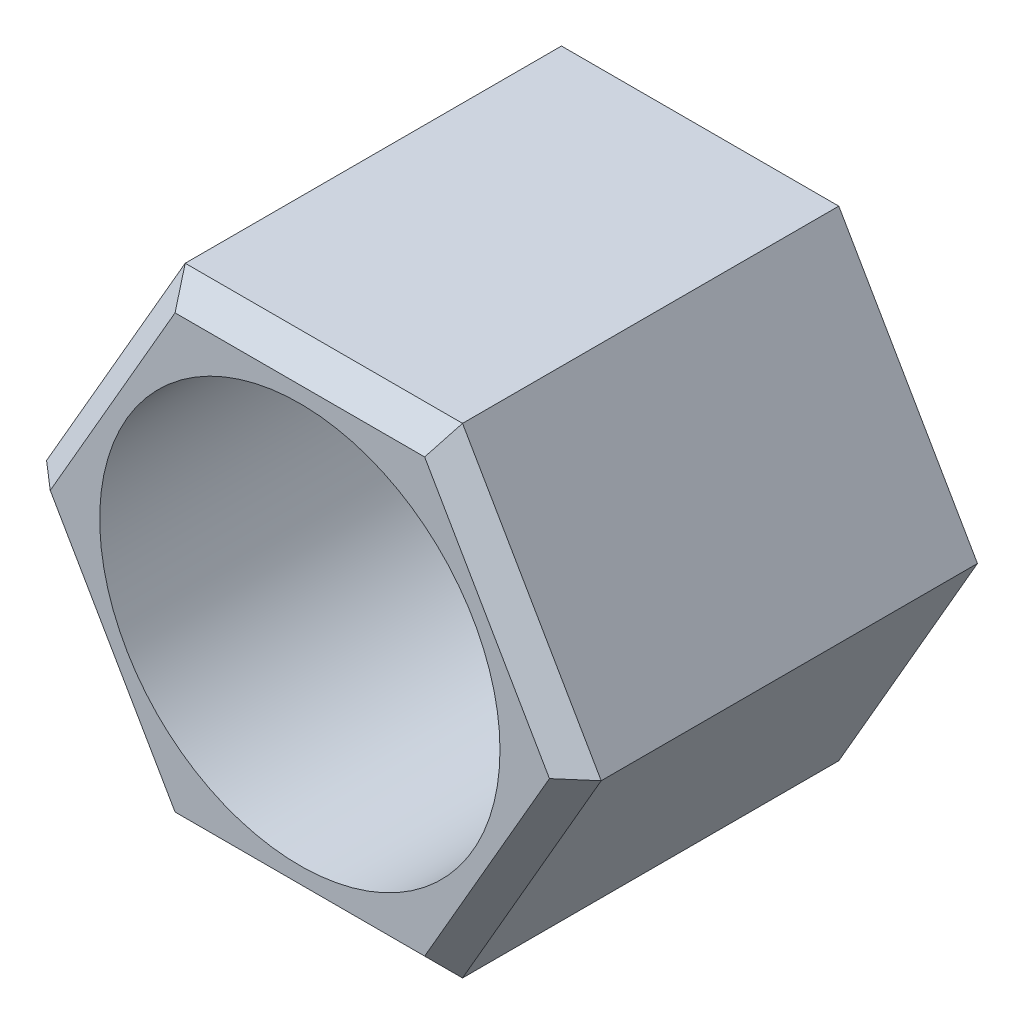
ISO-10303-21;
HEADER;
FILE_DESCRIPTION(('STEP AP214'),'2;1');
FILE_NAME('part.step','',(''),(''),'','','');
FILE_SCHEMA(('AUTOMOTIVE_DESIGN { 1 0 10303 214 1 1 1 1 }'));
ENDSEC;
DATA;
#1=APPLICATION_CONTEXT('core data for automotive mechanical design processes');
#2=APPLICATION_PROTOCOL_DEFINITION('international standard','automotive_design',2000,#1);
#3=PRODUCT_CONTEXT('',#1,'mechanical');
#4=PRODUCT('Part','Part','',(#3));
#5=PRODUCT_RELATED_PRODUCT_CATEGORY('part','',(#4));
#6=PRODUCT_DEFINITION_FORMATION('','',#4);
#7=PRODUCT_DEFINITION_CONTEXT('part definition',#1,'design');
#8=PRODUCT_DEFINITION('design','',#6,#7);
#9=PRODUCT_DEFINITION_SHAPE('','',#8);
#10=(LENGTH_UNIT() NAMED_UNIT(*) SI_UNIT(.MILLI.,.METRE.));
#11=(NAMED_UNIT(*) PLANE_ANGLE_UNIT() SI_UNIT($,.RADIAN.));
#12=(NAMED_UNIT(*) SI_UNIT($,.STERADIAN.) SOLID_ANGLE_UNIT());
#13=UNCERTAINTY_MEASURE_WITH_UNIT(LENGTH_MEASURE(1.E-05),#10,'distance_accuracy_value','');
#14=(GEOMETRIC_REPRESENTATION_CONTEXT(3) GLOBAL_UNCERTAINTY_ASSIGNED_CONTEXT((#13)) GLOBAL_UNIT_ASSIGNED_CONTEXT((#10,
#11,#12)) REPRESENTATION_CONTEXT('',''));
#15=CARTESIAN_POINT('',(0.,0.,0.));
#16=DIRECTION('',(0.,0.,1.));
#17=DIRECTION('',(1.,0.,0.));
#18=AXIS2_PLACEMENT_3D('',#15,#16,#17);
#19=CARTESIAN_POINT('',(4.39940905122495,-7.62,12.7));
#20=DIRECTION('',(-0.866025403784439,0.5,0.));
#21=DIRECTION('',(-0.5,-0.866025403784439,0.));
#22=AXIS2_PLACEMENT_3D('',#19,#20,#21);
#23=PLANE('',#22);
#24=DIRECTION('',(0.,0.,-1.));
#25=VECTOR('',#24,1.);
#26=CARTESIAN_POINT('',(8.7988181024499,0.,12.7));
#27=LINE('',#26,#25);
#28=CARTESIAN_POINT('',(8.7988181024499,0.,11.938));
#29=VERTEX_POINT('',#28);
#30=CARTESIAN_POINT('',(8.7988181024499,0.,0.));
#31=VERTEX_POINT('',#30);
#32=EDGE_CURVE('E93',#29,#31,#27,.T.);
#33=ORIENTED_EDGE('',*,*,#32,.F.);
#34=DIRECTION('',(-0.5,-0.866025403784439,0.));
#35=VECTOR('',#34,1.);
#36=CARTESIAN_POINT('',(4.39940905122495,-7.62,11.938));
#37=LINE('',#36,#35);
#38=CARTESIAN_POINT('',(4.39940905122495,-7.62,11.938));
#39=VERTEX_POINT('',#38);
#40=EDGE_CURVE('E11',#29,#39,#37,.T.);
#41=ORIENTED_EDGE('',*,*,#40,.T.);
#42=DIRECTION('',(0.,0.,-1.));
#43=VECTOR('',#42,1.);
#44=CARTESIAN_POINT('',(4.39940905122495,-7.62,12.7));
#45=LINE('',#44,#43);
#46=CARTESIAN_POINT('',(4.39940905122495,-7.62,0.));
#47=VERTEX_POINT('',#46);
#48=EDGE_CURVE('E114',#39,#47,#45,.T.);
#49=ORIENTED_EDGE('',*,*,#48,.T.);
#50=DIRECTION('',(0.5,0.866025403784439,0.));
#51=VECTOR('',#50,1.);
#52=CARTESIAN_POINT('',(4.39940905122495,-7.62,0.));
#53=LINE('',#52,#51);
#54=EDGE_CURVE('E108',#47,#31,#53,.T.);
#55=ORIENTED_EDGE('',*,*,#54,.T.);
#56=EDGE_LOOP('',(#33,#41,#49,#55));
#57=FACE_BOUND('',#56,.T.);
#58=ADVANCED_FACE('F26',(#57),#23,.F.);
#59=CARTESIAN_POINT('',(8.7988181024499,0.,12.7));
#60=DIRECTION('',(-0.866025403784439,-0.5,0.));
#61=DIRECTION('',(0.5,-0.866025403784439,0.));
#62=AXIS2_PLACEMENT_3D('',#59,#60,#61);
#63=PLANE('',#62);
#64=DIRECTION('',(0.,0.,-1.));
#65=VECTOR('',#64,1.);
#66=CARTESIAN_POINT('',(4.39940905122494,7.62000000000001,12.7));
#67=LINE('',#66,#65);
#68=CARTESIAN_POINT('',(4.39940905122494,7.62000000000001,11.938));
#69=VERTEX_POINT('',#68);
#70=CARTESIAN_POINT('',(4.39940905122494,7.62000000000001,0.));
#71=VERTEX_POINT('',#70);
#72=EDGE_CURVE('E102',#69,#71,#67,.T.);
#73=ORIENTED_EDGE('',*,*,#72,.F.);
#74=DIRECTION('',(0.5,-0.866025403784439,0.));
#75=VECTOR('',#74,1.);
#76=CARTESIAN_POINT('',(8.7988181024499,0.,11.938));
#77=LINE('',#76,#75);
#78=EDGE_CURVE('E33',#69,#29,#77,.T.);
#79=ORIENTED_EDGE('',*,*,#78,.T.);
#80=ORIENTED_EDGE('',*,*,#32,.T.);
#81=DIRECTION('',(-0.5,0.866025403784439,0.));
#82=VECTOR('',#81,1.);
#83=CARTESIAN_POINT('',(8.7988181024499,0.,0.));
#84=LINE('',#83,#82);
#85=EDGE_CURVE('E96',#31,#71,#84,.T.);
#86=ORIENTED_EDGE('',*,*,#85,.T.);
#87=EDGE_LOOP('',(#73,#79,#80,#86));
#88=FACE_BOUND('',#87,.T.);
#89=ADVANCED_FACE('F95',(#88),#63,.F.);
#90=CARTESIAN_POINT('',(4.39940905122494,7.62000000000001,12.7));
#91=DIRECTION('',(0.,-1.,0.));
#92=DIRECTION('',(0.,0.,-1.));
#93=AXIS2_PLACEMENT_3D('',#90,#91,#92);
#94=PLANE('',#93);
#95=DIRECTION('',(0.,0.,-1.));
#96=VECTOR('',#95,1.);
#97=CARTESIAN_POINT('',(-4.39940905122495,7.62000000000001,12.7));
#98=LINE('',#97,#96);
#99=CARTESIAN_POINT('',(-4.39940905122495,7.62000000000001,11.938));
#100=VERTEX_POINT('',#99);
#101=CARTESIAN_POINT('',(-4.39940905122495,7.62000000000001,0.));
#102=VERTEX_POINT('',#101);
#103=EDGE_CURVE('E137',#100,#102,#98,.T.);
#104=ORIENTED_EDGE('',*,*,#103,.F.);
#105=DIRECTION('',(1.,0.,0.));
#106=VECTOR('',#105,1.);
#107=CARTESIAN_POINT('',(4.39940905122494,7.62000000000001,11.938));
#108=LINE('',#107,#106);
#109=EDGE_CURVE('E47',#100,#69,#108,.T.);
#110=ORIENTED_EDGE('',*,*,#109,.T.);
#111=ORIENTED_EDGE('',*,*,#72,.T.);
#112=DIRECTION('',(-1.,0.,0.));
#113=VECTOR('',#112,1.);
#114=CARTESIAN_POINT('',(4.39940905122494,7.62000000000001,0.));
#115=LINE('',#114,#113);
#116=EDGE_CURVE('E111',#71,#102,#115,.T.);
#117=ORIENTED_EDGE('',*,*,#116,.T.);
#118=EDGE_LOOP('',(#104,#110,#111,#117));
#119=FACE_BOUND('',#118,.T.);
#120=ADVANCED_FACE('F167',(#119),#94,.F.);
#121=CARTESIAN_POINT('',(-4.39940905122495,7.62000000000001,12.7));
#122=DIRECTION('',(0.866025403784439,-0.5,0.));
#123=DIRECTION('',(0.5,0.866025403784439,0.));
#124=AXIS2_PLACEMENT_3D('',#121,#122,#123);
#125=PLANE('',#124);
#126=DIRECTION('',(0.,0.,-1.));
#127=VECTOR('',#126,1.);
#128=CARTESIAN_POINT('',(-8.7988181024499,0.,12.7));
#129=LINE('',#128,#127);
#130=CARTESIAN_POINT('',(-8.7988181024499,0.,11.938));
#131=VERTEX_POINT('',#130);
#132=CARTESIAN_POINT('',(-8.7988181024499,0.,0.));
#133=VERTEX_POINT('',#132);
#134=EDGE_CURVE('E135',#131,#133,#129,.T.);
#135=ORIENTED_EDGE('',*,*,#134,.F.);
#136=DIRECTION('',(0.5,0.866025403784439,0.));
#137=VECTOR('',#136,1.);
#138=CARTESIAN_POINT('',(-4.39940905122495,7.62000000000001,11.938));
#139=LINE('',#138,#137);
#140=EDGE_CURVE('E157',#131,#100,#139,.T.);
#141=ORIENTED_EDGE('',*,*,#140,.T.);
#142=ORIENTED_EDGE('',*,*,#103,.T.);
#143=DIRECTION('',(-0.5,-0.866025403784439,0.));
#144=VECTOR('',#143,1.);
#145=CARTESIAN_POINT('',(-4.39940905122495,7.62000000000001,0.));
#146=LINE('',#145,#144);
#147=EDGE_CURVE('E124',#102,#133,#146,.T.);
#148=ORIENTED_EDGE('',*,*,#147,.T.);
#149=EDGE_LOOP('',(#135,#141,#142,#148));
#150=FACE_BOUND('',#149,.T.);
#151=ADVANCED_FACE('F162',(#150),#125,.F.);
#152=CARTESIAN_POINT('',(-8.7988181024499,0.,12.7));
#153=DIRECTION('',(0.866025403784439,0.5,0.));
#154=DIRECTION('',(-0.5,0.866025403784439,0.));
#155=AXIS2_PLACEMENT_3D('',#152,#153,#154);
#156=PLANE('',#155);
#157=DIRECTION('',(0.,0.,-1.));
#158=VECTOR('',#157,1.);
#159=CARTESIAN_POINT('',(-4.39940905122495,-7.62,12.7));
#160=LINE('',#159,#158);
#161=CARTESIAN_POINT('',(-4.39940905122495,-7.62,11.938));
#162=VERTEX_POINT('',#161);
#163=CARTESIAN_POINT('',(-4.39940905122495,-7.62,0.));
#164=VERTEX_POINT('',#163);
#165=EDGE_CURVE('E133',#162,#164,#160,.T.);
#166=ORIENTED_EDGE('',*,*,#165,.F.);
#167=DIRECTION('',(-0.5,0.866025403784439,0.));
#168=VECTOR('',#167,1.);
#169=CARTESIAN_POINT('',(-8.7988181024499,0.,11.938));
#170=LINE('',#169,#168);
#171=EDGE_CURVE('E155',#162,#131,#170,.T.);
#172=ORIENTED_EDGE('',*,*,#171,.T.);
#173=ORIENTED_EDGE('',*,*,#134,.T.);
#174=DIRECTION('',(0.5,-0.866025403784439,0.));
#175=VECTOR('',#174,1.);
#176=CARTESIAN_POINT('',(-8.7988181024499,0.,0.));
#177=LINE('',#176,#175);
#178=EDGE_CURVE('E127',#133,#164,#177,.T.);
#179=ORIENTED_EDGE('',*,*,#178,.T.);
#180=EDGE_LOOP('',(#166,#172,#173,#179));
#181=FACE_BOUND('',#180,.T.);
#182=ADVANCED_FACE('F212',(#181),#156,.F.);
#183=CARTESIAN_POINT('',(-4.39940905122495,-7.62,12.7));
#184=DIRECTION('',(0.,1.,0.));
#185=DIRECTION('',(-1.,0.,0.));
#186=AXIS2_PLACEMENT_3D('',#183,#184,#185);
#187=PLANE('',#186);
#188=ORIENTED_EDGE('',*,*,#48,.F.);
#189=DIRECTION('',(-1.,0.,0.));
#190=VECTOR('',#189,1.);
#191=CARTESIAN_POINT('',(-4.39940905122495,-7.62,11.938));
#192=LINE('',#191,#190);
#193=EDGE_CURVE('E152',#39,#162,#192,.T.);
#194=ORIENTED_EDGE('',*,*,#193,.T.);
#195=ORIENTED_EDGE('',*,*,#165,.T.);
#196=DIRECTION('',(1.,0.,0.));
#197=VECTOR('',#196,1.);
#198=CARTESIAN_POINT('',(-4.39940905122495,-7.62,0.));
#199=LINE('',#198,#197);
#200=EDGE_CURVE('E130',#164,#47,#199,.T.);
#201=ORIENTED_EDGE('',*,*,#200,.T.);
#202=EDGE_LOOP('',(#188,#194,#195,#201));
#203=FACE_BOUND('',#202,.T.);
#204=ADVANCED_FACE('F211',(#203),#187,.F.);
#205=CARTESIAN_POINT('',(4.39940905122495,-7.62,12.7));
#206=DIRECTION('',(0.,0.,-1.));
#207=DIRECTION('',(-1.,0.,0.));
#208=AXIS2_PLACEMENT_3D('',#205,#206,#207);
#209=PLANE('',#208);
#210=DIRECTION('',(0.5,-0.866025403784439,0.));
#211=VECTOR('',#210,1.);
#212=CARTESIAN_POINT('',(-1.53979316792873,-11.049,12.7));
#213=LINE('',#212,#211);
#214=CARTESIAN_POINT('',(-7.91893629220491,0.,12.7));
#215=VERTEX_POINT('',#214);
#216=CARTESIAN_POINT('',(-3.95946814610246,-6.858,12.7));
#217=VERTEX_POINT('',#216);
#218=EDGE_CURVE('E147',#215,#217,#213,.T.);
#219=ORIENTED_EDGE('',*,*,#218,.T.);
#220=DIRECTION('',(1.,0.,0.));
#221=VECTOR('',#220,1.);
#222=CARTESIAN_POINT('',(4.39940905122495,-6.858,12.7));
#223=LINE('',#222,#221);
#224=CARTESIAN_POINT('',(3.95946814610245,-6.858,12.7));
#225=VERTEX_POINT('',#224);
#226=EDGE_CURVE('E149',#217,#225,#223,.T.);
#227=ORIENTED_EDGE('',*,*,#226,.T.);
#228=DIRECTION('',(0.5,0.866025403784439,0.));
#229=VECTOR('',#228,1.);
#230=CARTESIAN_POINT('',(3.73949769354121,-7.23900000000001,12.7));
#231=LINE('',#230,#229);
#232=CARTESIAN_POINT('',(7.91893629220491,0.,12.7));
#233=VERTEX_POINT('',#232);
#234=EDGE_CURVE('E101',#225,#233,#231,.T.);
#235=ORIENTED_EDGE('',*,*,#234,.T.);
#236=DIRECTION('',(-0.5,0.866025403784439,0.));
#237=VECTOR('',#236,1.);
#238=CARTESIAN_POINT('',(10.3386112703786,-4.191,12.7));
#239=LINE('',#238,#237);
#240=CARTESIAN_POINT('',(3.95946814610245,6.85800000000001,12.7));
#241=VERTEX_POINT('',#240);
#242=EDGE_CURVE('E141',#233,#241,#239,.T.);
#243=ORIENTED_EDGE('',*,*,#242,.T.);
#244=DIRECTION('',(-1.,0.,0.));
#245=VECTOR('',#244,1.);
#246=CARTESIAN_POINT('',(4.39940905122495,6.85800000000001,12.7));
#247=LINE('',#246,#245);
#248=CARTESIAN_POINT('',(-3.95946814610245,6.85800000000001,12.7));
#249=VERTEX_POINT('',#248);
#250=EDGE_CURVE('E143',#241,#249,#247,.T.);
#251=ORIENTED_EDGE('',*,*,#250,.T.);
#252=DIRECTION('',(-0.5,-0.866025403784439,0.));
#253=VECTOR('',#252,1.);
#254=CARTESIAN_POINT('',(-8.13890674476616,-0.381000000000005,12.7));
#255=LINE('',#254,#253);
#256=EDGE_CURVE('E145',#249,#215,#255,.T.);
#257=ORIENTED_EDGE('',*,*,#256,.T.);
#258=EDGE_LOOP('',(#219,#227,#235,#243,#251,#257));
#259=FACE_BOUND('',#258,.T.);
#260=CARTESIAN_POINT('',(0.,0.,12.7));
#261=DIRECTION('',(0.,0.,1.));
#262=DIRECTION('',(1.,0.,0.));
#263=AXIS2_PLACEMENT_3D('',#260,#261,#262);
#264=CIRCLE('',#263,6.35);
#265=CARTESIAN_POINT('',(6.35,0.,12.7));
#266=VERTEX_POINT('',#265);
#267=EDGE_CURVE('E119',#266,#266,#264,.T.);
#268=ORIENTED_EDGE('',*,*,#267,.F.);
#269=EDGE_LOOP('',(#268));
#270=FACE_BOUND('',#269,.T.);
#271=ADVANCED_FACE('F201',(#259,#270),#209,.F.);
#272=CARTESIAN_POINT('',(4.39940905122495,-7.62,0.));
#273=DIRECTION('',(0.,0.,-1.));
#274=DIRECTION('',(-1.,0.,0.));
#275=AXIS2_PLACEMENT_3D('',#272,#273,#274);
#276=PLANE('',#275);
#277=CARTESIAN_POINT('',(0.,0.,0.));
#278=DIRECTION('',(0.,0.,1.));
#279=DIRECTION('',(1.,0.,0.));
#280=AXIS2_PLACEMENT_3D('',#277,#278,#279);
#281=CIRCLE('',#280,6.35);
#282=CARTESIAN_POINT('',(6.35,0.,0.));
#283=VERTEX_POINT('',#282);
#284=EDGE_CURVE('E116',#283,#283,#281,.T.);
#285=ORIENTED_EDGE('',*,*,#284,.T.);
#286=EDGE_LOOP('',(#285));
#287=FACE_BOUND('',#286,.T.);
#288=ORIENTED_EDGE('',*,*,#54,.F.);
#289=ORIENTED_EDGE('',*,*,#200,.F.);
#290=ORIENTED_EDGE('',*,*,#178,.F.);
#291=ORIENTED_EDGE('',*,*,#147,.F.);
#292=ORIENTED_EDGE('',*,*,#116,.F.);
#293=ORIENTED_EDGE('',*,*,#85,.F.);
#294=EDGE_LOOP('',(#288,#289,#290,#291,#292,#293));
#295=FACE_BOUND('',#294,.T.);
#296=ADVANCED_FACE('F106',(#287,#295),#276,.T.);
#297=CARTESIAN_POINT('',(0.,0.,0.));
#298=DIRECTION('',(0.,0.,1.));
#299=DIRECTION('',(1.,0.,0.));
#300=AXIS2_PLACEMENT_3D('',#297,#298,#299);
#301=CYLINDRICAL_SURFACE('',#300,6.35);
#302=ORIENTED_EDGE('',*,*,#284,.F.);
#303=EDGE_LOOP('',(#302));
#304=FACE_BOUND('',#303,.T.);
#305=ORIENTED_EDGE('',*,*,#267,.T.);
#306=EDGE_LOOP('',(#305));
#307=FACE_BOUND('',#306,.T.);
#308=ADVANCED_FACE('F257',(#304,#307),#301,.F.);
#309=CARTESIAN_POINT('',(4.39940905122495,6.85800000000001,12.7));
#310=DIRECTION('',(0.,-0.707106781186548,-0.707106781186547));
#311=DIRECTION('',(0.,0.707106781186547,-0.707106781186548));
#312=AXIS2_PLACEMENT_3D('',#309,#310,#311);
#313=PLANE('',#312);
#314=DIRECTION('',(-0.377964473009227,-0.654653670707977,0.654653670707978));
#315=VECTOR('',#314,1.);
#316=CARTESIAN_POINT('',(2.13685582488069,3.70114285714287,15.8568571428571));
#317=LINE('',#316,#315);
#318=EDGE_CURVE('E176',#69,#241,#317,.T.);
#319=ORIENTED_EDGE('',*,*,#318,.F.);
#320=ORIENTED_EDGE('',*,*,#109,.F.);
#321=DIRECTION('',(0.377964473009228,-0.654653670707976,0.654653670707978));
#322=VECTOR('',#321,1.);
#323=CARTESIAN_POINT('',(-2.76534283219853,4.78971428571429,14.7682857142857));
#324=LINE('',#323,#322);
#325=EDGE_CURVE('E173',#249,#100,#324,.F.);
#326=ORIENTED_EDGE('',*,*,#325,.F.);
#327=ORIENTED_EDGE('',*,*,#250,.F.);
#328=EDGE_LOOP('',(#319,#320,#326,#327));
#329=FACE_BOUND('',#328,.T.);
#330=ADVANCED_FACE('F171',(#329),#313,.F.);
#331=CARTESIAN_POINT('',(-8.13890674476616,-0.381000000000005,12.7));
#332=DIRECTION('',(0.612372435695795,-0.353553390593274,-0.707106781186547));
#333=DIRECTION('',(-0.755928946018454,0.,-0.654653670707977));
#334=AXIS2_PLACEMENT_3D('',#331,#332,#333);
#335=PLANE('',#334);
#336=ORIENTED_EDGE('',*,*,#325,.T.);
#337=ORIENTED_EDGE('',*,*,#140,.F.);
#338=DIRECTION('',(0.755928946018454,0.,0.654653670707978));
#339=VECTOR('',#338,1.);
#340=CARTESIAN_POINT('',(-8.04463369366848,0.,12.5911428571429));
#341=LINE('',#340,#339);
#342=EDGE_CURVE('E180',#215,#131,#341,.F.);
#343=ORIENTED_EDGE('',*,*,#342,.F.);
#344=ORIENTED_EDGE('',*,*,#256,.F.);
#345=EDGE_LOOP('',(#336,#337,#343,#344));
#346=FACE_BOUND('',#345,.T.);
#347=ADVANCED_FACE('F177',(#346),#335,.F.);
#348=CARTESIAN_POINT('',(10.3386112703786,-4.191,12.7));
#349=DIRECTION('',(-0.612372435695795,-0.353553390593274,-0.707106781186547));
#350=DIRECTION('',(-0.755928946018454,0.,0.654653670707978));
#351=AXIS2_PLACEMENT_3D('',#348,#349,#350);
#352=PLANE('',#351);
#353=ORIENTED_EDGE('',*,*,#318,.T.);
#354=ORIENTED_EDGE('',*,*,#242,.F.);
#355=DIRECTION('',(-0.755928946018453,0.,0.654653670707978));
#356=VECTOR('',#355,1.);
#357=CARTESIAN_POINT('',(5.53068566439708,0.,14.7682857142857));
#358=LINE('',#357,#356);
#359=EDGE_CURVE('E184',#29,#233,#358,.T.);
#360=ORIENTED_EDGE('',*,*,#359,.F.);
#361=ORIENTED_EDGE('',*,*,#78,.F.);
#362=EDGE_LOOP('',(#353,#354,#360,#361));
#363=FACE_BOUND('',#362,.T.);
#364=ADVANCED_FACE('F276',(#363),#352,.F.);
#365=CARTESIAN_POINT('',(-1.53979316792873,-11.049,12.7));
#366=DIRECTION('',(0.612372435695795,0.353553390593274,-0.707106781186547));
#367=DIRECTION('',(-0.755928946018454,0.,-0.654653670707977));
#368=AXIS2_PLACEMENT_3D('',#365,#366,#367);
#369=PLANE('',#368);
#370=ORIENTED_EDGE('',*,*,#342,.T.);
#371=ORIENTED_EDGE('',*,*,#171,.F.);
#372=DIRECTION('',(0.377964473009228,0.654653670707976,0.654653670707978));
#373=VECTOR('',#372,1.);
#374=CARTESIAN_POINT('',(-4.65080385415209,-8.05542857142857,11.5025714285714));
#375=LINE('',#374,#373);
#376=EDGE_CURVE('E187',#217,#162,#375,.F.);
#377=ORIENTED_EDGE('',*,*,#376,.F.);
#378=ORIENTED_EDGE('',*,*,#218,.F.);
#379=EDGE_LOOP('',(#370,#371,#377,#378));
#380=FACE_BOUND('',#379,.T.);
#381=ADVANCED_FACE('F207',(#380),#369,.F.);
#382=CARTESIAN_POINT('',(3.73949769354121,-7.23900000000001,12.7));
#383=DIRECTION('',(-0.612372435695796,0.353553390593274,-0.707106781186546));
#384=DIRECTION('',(-0.755928946018453,0.,0.654653670707979));
#385=AXIS2_PLACEMENT_3D('',#382,#383,#384);
#386=PLANE('',#385);
#387=ORIENTED_EDGE('',*,*,#359,.T.);
#388=ORIENTED_EDGE('',*,*,#234,.F.);
#389=DIRECTION('',(0.377964473009226,-0.654653670707977,-0.654653670707978));
#390=VECTOR('',#389,1.);
#391=CARTESIAN_POINT('',(4.02231684683424,-6.96685714285715,12.5911428571429));
#392=LINE('',#391,#390);
#393=EDGE_CURVE('E189',#39,#225,#392,.F.);
#394=ORIENTED_EDGE('',*,*,#393,.F.);
#395=ORIENTED_EDGE('',*,*,#40,.F.);
#396=EDGE_LOOP('',(#387,#388,#394,#395));
#397=FACE_BOUND('',#396,.T.);
#398=ADVANCED_FACE('F198',(#397),#386,.F.);
#399=CARTESIAN_POINT('',(4.39940905122495,-6.858,12.7));
#400=DIRECTION('',(0.,0.707106781186548,-0.707106781186547));
#401=DIRECTION('',(0.,0.707106781186547,0.707106781186548));
#402=AXIS2_PLACEMENT_3D('',#399,#400,#401);
#403=PLANE('',#402);
#404=ORIENTED_EDGE('',*,*,#376,.T.);
#405=ORIENTED_EDGE('',*,*,#193,.F.);
#406=ORIENTED_EDGE('',*,*,#393,.T.);
#407=ORIENTED_EDGE('',*,*,#226,.F.);
#408=EDGE_LOOP('',(#404,#405,#406,#407));
#409=FACE_BOUND('',#408,.T.);
#410=ADVANCED_FACE('F195',(#409),#403,.F.);
#411=CLOSED_SHELL('',(#58,#89,#120,#151,#182,#204,#271,#296,#308,#330,#347,#364,#381,#398,#410));
#412=MANIFOLD_SOLID_BREP('B2',#411);
#413=ADVANCED_BREP_SHAPE_REPRESENTATION('',(#18,#412),#14);
#414=SHAPE_DEFINITION_REPRESENTATION(#9,#413);
ENDSEC;
END-ISO-10303-21;
